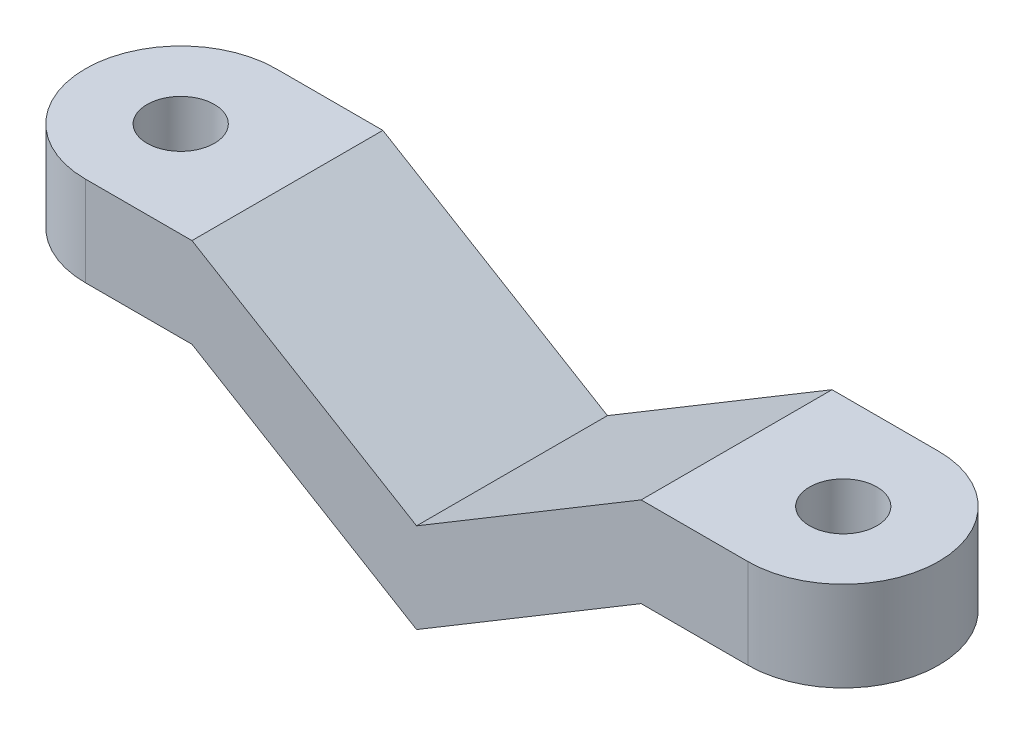
ISO-10303-21;
HEADER;
FILE_DESCRIPTION(('STEP AP214'),'2;1');
FILE_NAME('part.step','',(''),(''),'','','');
FILE_SCHEMA(('AUTOMOTIVE_DESIGN { 1 0 10303 214 1 1 1 1 }'));
ENDSEC;
DATA;
#1=APPLICATION_CONTEXT('core data for automotive mechanical design processes');
#2=APPLICATION_PROTOCOL_DEFINITION('international standard','automotive_design',2000,#1);
#3=PRODUCT_CONTEXT('',#1,'mechanical');
#4=PRODUCT('Part','Part','',(#3));
#5=PRODUCT_RELATED_PRODUCT_CATEGORY('part','',(#4));
#6=PRODUCT_DEFINITION_FORMATION('','',#4);
#7=PRODUCT_DEFINITION_CONTEXT('part definition',#1,'design');
#8=PRODUCT_DEFINITION('design','',#6,#7);
#9=PRODUCT_DEFINITION_SHAPE('','',#8);
#10=(LENGTH_UNIT() NAMED_UNIT(*) SI_UNIT(.MILLI.,.METRE.));
#11=(NAMED_UNIT(*) PLANE_ANGLE_UNIT() SI_UNIT($,.RADIAN.));
#12=(NAMED_UNIT(*) SI_UNIT($,.STERADIAN.) SOLID_ANGLE_UNIT());
#13=UNCERTAINTY_MEASURE_WITH_UNIT(LENGTH_MEASURE(1.E-05),#10,'distance_accuracy_value','');
#14=(GEOMETRIC_REPRESENTATION_CONTEXT(3) GLOBAL_UNCERTAINTY_ASSIGNED_CONTEXT((#13)) GLOBAL_UNIT_ASSIGNED_CONTEXT((#10,
#11,#12)) REPRESENTATION_CONTEXT('',''));
#15=CARTESIAN_POINT('',(0.,0.,0.));
#16=DIRECTION('',(0.,0.,1.));
#17=DIRECTION('',(1.,0.,0.));
#18=AXIS2_PLACEMENT_3D('',#15,#16,#17);
#19=CARTESIAN_POINT('',(0.,10.,4.25));
#20=DIRECTION('',(0.,0.,-1.));
#21=DIRECTION('',(-1.,0.,0.));
#22=AXIS2_PLACEMENT_3D('',#19,#20,#21);
#23=PLANE('',#22);
#24=DIRECTION('',(1.,0.,0.));
#25=VECTOR('',#24,1.);
#26=CARTESIAN_POINT('',(0.,6.,4.25));
#27=LINE('',#26,#25);
#28=CARTESIAN_POINT('',(24.75,6.,4.25));
#29=VERTEX_POINT('',#28);
#30=CARTESIAN_POINT('',(29.5,6.,4.25));
#31=VERTEX_POINT('',#30);
#32=EDGE_CURVE('E192',#29,#31,#27,.T.);
#33=ORIENTED_EDGE('',*,*,#32,.T.);
#34=DIRECTION('',(0.,-1.,0.));
#35=VECTOR('',#34,1.);
#36=CARTESIAN_POINT('',(29.5,10.,4.25));
#37=LINE('',#36,#35);
#38=CARTESIAN_POINT('',(29.5,10.,4.25));
#39=VERTEX_POINT('',#38);
#40=EDGE_CURVE('E245',#39,#31,#37,.T.);
#41=ORIENTED_EDGE('',*,*,#40,.F.);
#42=DIRECTION('',(1.,0.,0.));
#43=VECTOR('',#42,1.);
#44=CARTESIAN_POINT('',(0.,10.,4.25));
#45=LINE('',#44,#43);
#46=CARTESIAN_POINT('',(24.75,10.,4.25));
#47=VERTEX_POINT('',#46);
#48=EDGE_CURVE('E238',#47,#39,#45,.T.);
#49=ORIENTED_EDGE('',*,*,#48,.F.);
#50=DIRECTION('',(0.857492925712544,0.514495755427527,0.));
#51=VECTOR('',#50,1.);
#52=CARTESIAN_POINT('',(2.13970588235295,-3.56617647058824,4.25));
#53=LINE('',#52,#51);
#54=CARTESIAN_POINT('',(14.75,4.,4.25));
#55=VERTEX_POINT('',#54);
#56=EDGE_CURVE('E118',#55,#47,#53,.T.);
#57=ORIENTED_EDGE('',*,*,#56,.F.);
#58=DIRECTION('',(0.857492925712544,-0.514495755427526,0.));
#59=VECTOR('',#58,1.);
#60=CARTESIAN_POINT('',(5.66911764705882,9.44852941176471,4.25));
#61=LINE('',#60,#59);
#62=CARTESIAN_POINT('',(4.74999999999999,10.,4.25));
#63=VERTEX_POINT('',#62);
#64=EDGE_CURVE('E219',#63,#55,#61,.T.);
#65=ORIENTED_EDGE('',*,*,#64,.F.);
#66=CARTESIAN_POINT('',(0.,10.,4.25));
#67=VERTEX_POINT('',#66);
#68=EDGE_CURVE('E239',#67,#63,#45,.T.);
#69=ORIENTED_EDGE('',*,*,#68,.F.);
#70=DIRECTION('',(0.,-1.,0.));
#71=VECTOR('',#70,1.);
#72=CARTESIAN_POINT('',(0.,10.,4.25));
#73=LINE('',#72,#71);
#74=CARTESIAN_POINT('',(0.,6.,4.25));
#75=VERTEX_POINT('',#74);
#76=EDGE_CURVE('E126',#67,#75,#73,.T.);
#77=ORIENTED_EDGE('',*,*,#76,.T.);
#78=DIRECTION('',(1.,0.,0.));
#79=VECTOR('',#78,1.);
#80=CARTESIAN_POINT('',(0.,6.,4.25));
#81=LINE('',#80,#79);
#82=CARTESIAN_POINT('',(4.75,6.,4.25));
#83=VERTEX_POINT('',#82);
#84=EDGE_CURVE('E210',#75,#83,#81,.T.);
#85=ORIENTED_EDGE('',*,*,#84,.T.);
#86=DIRECTION('',(0.857492925712544,-0.514495755427526,0.));
#87=VECTOR('',#86,1.);
#88=CARTESIAN_POINT('',(3.90441176470588,6.50735294117647,4.25));
#89=LINE('',#88,#87);
#90=CARTESIAN_POINT('',(14.75,0.,4.25));
#91=VERTEX_POINT('',#90);
#92=EDGE_CURVE('E202',#83,#91,#89,.T.);
#93=ORIENTED_EDGE('',*,*,#92,.T.);
#94=DIRECTION('',(0.857492925712544,0.514495755427527,0.));
#95=VECTOR('',#94,1.);
#96=CARTESIAN_POINT('',(3.90441176470589,-6.50735294117647,4.25));
#97=LINE('',#96,#95);
#98=EDGE_CURVE('E184',#91,#29,#97,.T.);
#99=ORIENTED_EDGE('',*,*,#98,.T.);
#100=EDGE_LOOP('',(#33,#41,#49,#57,#65,#69,#77,#85,#93,#99));
#101=FACE_BOUND('',#100,.T.);
#102=ADVANCED_FACE('F101',(#101),#23,.F.);
#103=CARTESIAN_POINT('',(0.,10.,-4.25));
#104=DIRECTION('',(0.,0.,-1.));
#105=DIRECTION('',(-1.,0.,0.));
#106=AXIS2_PLACEMENT_3D('',#103,#104,#105);
#107=PLANE('',#106);
#108=DIRECTION('',(0.,-1.,0.));
#109=VECTOR('',#108,1.);
#110=CARTESIAN_POINT('',(29.5,10.,-4.25));
#111=LINE('',#110,#109);
#112=CARTESIAN_POINT('',(29.5,10.,-4.25));
#113=VERTEX_POINT('',#112);
#114=CARTESIAN_POINT('',(29.5,6.,-4.25));
#115=VERTEX_POINT('',#114);
#116=EDGE_CURVE('E247',#113,#115,#111,.T.);
#117=ORIENTED_EDGE('',*,*,#116,.T.);
#118=DIRECTION('',(-1.,0.,0.));
#119=VECTOR('',#118,1.);
#120=CARTESIAN_POINT('',(0.,6.,-4.25));
#121=LINE('',#120,#119);
#122=CARTESIAN_POINT('',(24.75,6.,-4.25));
#123=VERTEX_POINT('',#122);
#124=EDGE_CURVE('E207',#115,#123,#121,.T.);
#125=ORIENTED_EDGE('',*,*,#124,.T.);
#126=DIRECTION('',(-0.857492925712544,-0.514495755427527,0.));
#127=VECTOR('',#126,1.);
#128=CARTESIAN_POINT('',(8.31617647058824,-3.86029411764706,-4.25));
#129=LINE('',#128,#127);
#130=CARTESIAN_POINT('',(14.75,0.,-4.25));
#131=VERTEX_POINT('',#130);
#132=EDGE_CURVE('E187',#123,#131,#129,.T.);
#133=ORIENTED_EDGE('',*,*,#132,.T.);
#134=DIRECTION('',(-0.857492925712544,0.514495755427526,0.));
#135=VECTOR('',#134,1.);
#136=CARTESIAN_POINT('',(-0.507352941176471,9.15441176470588,-4.25));
#137=LINE('',#136,#135);
#138=CARTESIAN_POINT('',(4.75,6.,-4.25));
#139=VERTEX_POINT('',#138);
#140=EDGE_CURVE('E214',#131,#139,#137,.T.);
#141=ORIENTED_EDGE('',*,*,#140,.T.);
#142=DIRECTION('',(-1.,0.,0.));
#143=VECTOR('',#142,1.);
#144=CARTESIAN_POINT('',(0.,6.,-4.25));
#145=LINE('',#144,#143);
#146=CARTESIAN_POINT('',(0.,6.,-4.25));
#147=VERTEX_POINT('',#146);
#148=EDGE_CURVE('E110',#139,#147,#145,.T.);
#149=ORIENTED_EDGE('',*,*,#148,.T.);
#150=DIRECTION('',(0.,-1.,0.));
#151=VECTOR('',#150,1.);
#152=CARTESIAN_POINT('',(0.,10.,-4.25));
#153=LINE('',#152,#151);
#154=CARTESIAN_POINT('',(0.,10.,-4.25));
#155=VERTEX_POINT('',#154);
#156=EDGE_CURVE('E242',#155,#147,#153,.T.);
#157=ORIENTED_EDGE('',*,*,#156,.F.);
#158=DIRECTION('',(1.,0.,0.));
#159=VECTOR('',#158,1.);
#160=CARTESIAN_POINT('',(0.,10.,-4.25));
#161=LINE('',#160,#159);
#162=CARTESIAN_POINT('',(4.74999999999999,10.,-4.25));
#163=VERTEX_POINT('',#162);
#164=EDGE_CURVE('E232',#155,#163,#161,.T.);
#165=ORIENTED_EDGE('',*,*,#164,.T.);
#166=DIRECTION('',(-0.857492925712544,0.514495755427526,0.));
#167=VECTOR('',#166,1.);
#168=CARTESIAN_POINT('',(1.25735294117647,12.0955882352941,-4.25));
#169=LINE('',#168,#167);
#170=CARTESIAN_POINT('',(14.75,4.,-4.25));
#171=VERTEX_POINT('',#170);
#172=EDGE_CURVE('E227',#171,#163,#169,.T.);
#173=ORIENTED_EDGE('',*,*,#172,.F.);
#174=DIRECTION('',(-0.857492925712544,-0.514495755427527,0.));
#175=VECTOR('',#174,1.);
#176=CARTESIAN_POINT('',(6.5514705882353,-0.919117647058831,-4.25));
#177=LINE('',#176,#175);
#178=CARTESIAN_POINT('',(24.75,10.,-4.25));
#179=VERTEX_POINT('',#178);
#180=EDGE_CURVE('E225',#179,#171,#177,.T.);
#181=ORIENTED_EDGE('',*,*,#180,.F.);
#182=EDGE_CURVE('E231',#179,#113,#161,.T.);
#183=ORIENTED_EDGE('',*,*,#182,.T.);
#184=EDGE_LOOP('',(#117,#125,#133,#141,#149,#157,#165,#173,#181,#183));
#185=FACE_BOUND('',#184,.T.);
#186=ADVANCED_FACE('F286',(#185),#107,.T.);
#187=CARTESIAN_POINT('',(29.5,10.,0.));
#188=DIRECTION('',(0.,-1.,0.));
#189=DIRECTION('',(0.,0.,-1.));
#190=AXIS2_PLACEMENT_3D('',#187,#188,#189);
#191=CYLINDRICAL_SURFACE('',#190,4.25);
#192=ORIENTED_EDGE('',*,*,#40,.T.);
#193=CARTESIAN_POINT('',(29.5,6.,0.));
#194=DIRECTION('',(0.,-1.,0.));
#195=DIRECTION('',(0.,0.,-1.));
#196=AXIS2_PLACEMENT_3D('',#193,#194,#195);
#197=CIRCLE('',#196,4.25);
#198=EDGE_CURVE('E12',#31,#115,#197,.F.);
#199=ORIENTED_EDGE('',*,*,#198,.T.);
#200=ORIENTED_EDGE('',*,*,#116,.F.);
#201=CARTESIAN_POINT('',(29.5,10.,0.));
#202=DIRECTION('',(0.,-1.,0.));
#203=DIRECTION('',(0.,0.,-1.));
#204=AXIS2_PLACEMENT_3D('',#201,#202,#203);
#205=CIRCLE('',#204,4.25);
#206=EDGE_CURVE('E235',#113,#39,#205,.T.);
#207=ORIENTED_EDGE('',*,*,#206,.T.);
#208=EDGE_LOOP('',(#192,#199,#200,#207));
#209=FACE_BOUND('',#208,.T.);
#210=ADVANCED_FACE('F289',(#209),#191,.T.);
#211=CARTESIAN_POINT('',(0.,10.,0.));
#212=DIRECTION('',(0.,-1.,0.));
#213=DIRECTION('',(0.,0.,-1.));
#214=AXIS2_PLACEMENT_3D('',#211,#212,#213);
#215=CYLINDRICAL_SURFACE('',#214,4.25);
#216=CARTESIAN_POINT('',(0.,6.,0.));
#217=DIRECTION('',(0.,-1.,0.));
#218=DIRECTION('',(0.,0.,-1.));
#219=AXIS2_PLACEMENT_3D('',#216,#217,#218);
#220=CIRCLE('',#219,4.25);
#221=EDGE_CURVE('E217',#147,#75,#220,.F.);
#222=ORIENTED_EDGE('',*,*,#221,.T.);
#223=ORIENTED_EDGE('',*,*,#76,.F.);
#224=CARTESIAN_POINT('',(0.,10.,0.));
#225=DIRECTION('',(0.,-1.,0.));
#226=DIRECTION('',(0.,0.,-1.));
#227=AXIS2_PLACEMENT_3D('',#224,#225,#226);
#228=CIRCLE('',#227,4.25);
#229=EDGE_CURVE('E229',#67,#155,#228,.T.);
#230=ORIENTED_EDGE('',*,*,#229,.T.);
#231=ORIENTED_EDGE('',*,*,#156,.T.);
#232=EDGE_LOOP('',(#222,#223,#230,#231));
#233=FACE_BOUND('',#232,.T.);
#234=ADVANCED_FACE('F103',(#233),#215,.T.);
#235=CARTESIAN_POINT('',(0.,10.,0.));
#236=DIRECTION('',(0.,-1.,0.));
#237=DIRECTION('',(0.,0.,-1.));
#238=AXIS2_PLACEMENT_3D('',#235,#236,#237);
#239=PLANE('',#238);
#240=CARTESIAN_POINT('',(0.,10.,0.));
#241=DIRECTION('',(0.,1.,0.));
#242=DIRECTION('',(0.,0.,1.));
#243=AXIS2_PLACEMENT_3D('',#240,#241,#242);
#244=CIRCLE('',#243,1.5);
#245=CARTESIAN_POINT('',(0.,10.,1.5));
#246=VERTEX_POINT('',#245);
#247=EDGE_CURVE('E260',#246,#246,#244,.T.);
#248=ORIENTED_EDGE('',*,*,#247,.F.);
#249=EDGE_LOOP('',(#248));
#250=FACE_BOUND('',#249,.T.);
#251=ORIENTED_EDGE('',*,*,#68,.T.);
#252=DIRECTION('',(0.,0.,-1.));
#253=VECTOR('',#252,1.);
#254=CARTESIAN_POINT('',(4.75,10.,0.));
#255=LINE('',#254,#253);
#256=EDGE_CURVE('E253',#63,#163,#255,.T.);
#257=ORIENTED_EDGE('',*,*,#256,.T.);
#258=ORIENTED_EDGE('',*,*,#164,.F.);
#259=ORIENTED_EDGE('',*,*,#229,.F.);
#260=EDGE_LOOP('',(#251,#257,#258,#259));
#261=FACE_BOUND('',#260,.T.);
#262=ADVANCED_FACE('F278',(#250,#261),#239,.F.);
#263=CARTESIAN_POINT('',(29.5,10.,0.));
#264=DIRECTION('',(0.,1.,0.));
#265=DIRECTION('',(0.,0.,1.));
#266=AXIS2_PLACEMENT_3D('',#263,#264,#265);
#267=CIRCLE('',#266,1.5);
#268=CARTESIAN_POINT('',(29.5,10.,1.5));
#269=VERTEX_POINT('',#268);
#270=EDGE_CURVE('E267',#269,#269,#267,.T.);
#271=ORIENTED_EDGE('',*,*,#270,.F.);
#272=EDGE_LOOP('',(#271));
#273=FACE_BOUND('',#272,.T.);
#274=ORIENTED_EDGE('',*,*,#182,.F.);
#275=DIRECTION('',(0.,0.,1.));
#276=VECTOR('',#275,1.);
#277=CARTESIAN_POINT('',(24.75,10.,0.));
#278=LINE('',#277,#276);
#279=EDGE_CURVE('E244',#179,#47,#278,.T.);
#280=ORIENTED_EDGE('',*,*,#279,.T.);
#281=ORIENTED_EDGE('',*,*,#48,.T.);
#282=ORIENTED_EDGE('',*,*,#206,.F.);
#283=EDGE_LOOP('',(#274,#280,#281,#282));
#284=FACE_BOUND('',#283,.T.);
#285=ADVANCED_FACE('F274',(#273,#284),#239,.F.);
#286=CARTESIAN_POINT('',(5.66911764705882,9.44852941176471,-5.75));
#287=DIRECTION('',(-0.514495755427526,-0.857492925712544,0.));
#288=DIRECTION('',(0.857492925712544,-0.514495755427526,0.));
#289=AXIS2_PLACEMENT_3D('',#286,#287,#288);
#290=PLANE('',#289);
#291=ORIENTED_EDGE('',*,*,#172,.T.);
#292=ORIENTED_EDGE('',*,*,#256,.F.);
#293=ORIENTED_EDGE('',*,*,#64,.T.);
#294=DIRECTION('',(0.,0.,1.));
#295=VECTOR('',#294,1.);
#296=CARTESIAN_POINT('',(14.75,4.,-5.75));
#297=LINE('',#296,#295);
#298=EDGE_CURVE('E223',#171,#55,#297,.T.);
#299=ORIENTED_EDGE('',*,*,#298,.F.);
#300=EDGE_LOOP('',(#291,#292,#293,#299));
#301=FACE_BOUND('',#300,.T.);
#302=ADVANCED_FACE('F277',(#301),#290,.F.);
#303=CARTESIAN_POINT('',(2.13970588235295,-3.56617647058824,-5.75));
#304=DIRECTION('',(0.514495755427527,-0.857492925712544,0.));
#305=DIRECTION('',(0.857492925712544,0.514495755427527,0.));
#306=AXIS2_PLACEMENT_3D('',#303,#304,#305);
#307=PLANE('',#306);
#308=ORIENTED_EDGE('',*,*,#180,.T.);
#309=ORIENTED_EDGE('',*,*,#298,.T.);
#310=ORIENTED_EDGE('',*,*,#56,.T.);
#311=ORIENTED_EDGE('',*,*,#279,.F.);
#312=EDGE_LOOP('',(#308,#309,#310,#311));
#313=FACE_BOUND('',#312,.T.);
#314=ADVANCED_FACE('F304',(#313),#307,.F.);
#315=CARTESIAN_POINT('',(3.90441176470588,6.50735294117647,-5.75));
#316=DIRECTION('',(-0.514495755427526,-0.857492925712544,0.));
#317=DIRECTION('',(0.857492925712544,-0.514495755427526,0.));
#318=AXIS2_PLACEMENT_3D('',#315,#316,#317);
#319=PLANE('',#318);
#320=DIRECTION('',(0.,0.,-1.));
#321=VECTOR('',#320,1.);
#322=CARTESIAN_POINT('',(14.75,0.,0.));
#323=LINE('',#322,#321);
#324=EDGE_CURVE('E256',#91,#131,#323,.T.);
#325=ORIENTED_EDGE('',*,*,#324,.F.);
#326=ORIENTED_EDGE('',*,*,#92,.F.);
#327=DIRECTION('',(0.,0.,1.));
#328=VECTOR('',#327,1.);
#329=CARTESIAN_POINT('',(4.75,6.,-5.75));
#330=LINE('',#329,#328);
#331=EDGE_CURVE('E212',#139,#83,#330,.T.);
#332=ORIENTED_EDGE('',*,*,#331,.F.);
#333=ORIENTED_EDGE('',*,*,#140,.F.);
#334=EDGE_LOOP('',(#325,#326,#332,#333));
#335=FACE_BOUND('',#334,.T.);
#336=ADVANCED_FACE('F302',(#335),#319,.T.);
#337=CARTESIAN_POINT('',(0.,6.,-5.75));
#338=DIRECTION('',(0.,-1.,0.));
#339=DIRECTION('',(0.,0.,-1.));
#340=AXIS2_PLACEMENT_3D('',#337,#338,#339);
#341=PLANE('',#340);
#342=CARTESIAN_POINT('',(0.,6.,0.));
#343=DIRECTION('',(0.,-1.,0.));
#344=DIRECTION('',(0.,0.,-1.));
#345=AXIS2_PLACEMENT_3D('',#342,#343,#344);
#346=CIRCLE('',#345,1.5);
#347=CARTESIAN_POINT('',(0.,6.,-1.5));
#348=VERTEX_POINT('',#347);
#349=EDGE_CURVE('E197',#348,#348,#346,.T.);
#350=ORIENTED_EDGE('',*,*,#349,.F.);
#351=EDGE_LOOP('',(#350));
#352=FACE_BOUND('',#351,.T.);
#353=ORIENTED_EDGE('',*,*,#221,.F.);
#354=ORIENTED_EDGE('',*,*,#148,.F.);
#355=ORIENTED_EDGE('',*,*,#331,.T.);
#356=ORIENTED_EDGE('',*,*,#84,.F.);
#357=EDGE_LOOP('',(#353,#354,#355,#356));
#358=FACE_BOUND('',#357,.T.);
#359=ADVANCED_FACE('F300',(#352,#358),#341,.T.);
#360=CARTESIAN_POINT('',(0.,6.,-5.75));
#361=DIRECTION('',(0.,-1.,0.));
#362=DIRECTION('',(0.,0.,-1.));
#363=AXIS2_PLACEMENT_3D('',#360,#361,#362);
#364=PLANE('',#363);
#365=CARTESIAN_POINT('',(29.5,6.,0.));
#366=DIRECTION('',(0.,-1.,0.));
#367=DIRECTION('',(0.,0.,-1.));
#368=AXIS2_PLACEMENT_3D('',#365,#366,#367);
#369=CIRCLE('',#368,1.5);
#370=CARTESIAN_POINT('',(29.5,6.,-1.5));
#371=VERTEX_POINT('',#370);
#372=EDGE_CURVE('E105',#371,#371,#369,.T.);
#373=ORIENTED_EDGE('',*,*,#372,.F.);
#374=EDGE_LOOP('',(#373));
#375=FACE_BOUND('',#374,.T.);
#376=ORIENTED_EDGE('',*,*,#198,.F.);
#377=ORIENTED_EDGE('',*,*,#32,.F.);
#378=DIRECTION('',(0.,0.,1.));
#379=VECTOR('',#378,1.);
#380=CARTESIAN_POINT('',(24.75,6.,-5.75));
#381=LINE('',#380,#379);
#382=EDGE_CURVE('E180',#123,#29,#381,.T.);
#383=ORIENTED_EDGE('',*,*,#382,.F.);
#384=ORIENTED_EDGE('',*,*,#124,.F.);
#385=EDGE_LOOP('',(#376,#377,#383,#384));
#386=FACE_BOUND('',#385,.T.);
#387=ADVANCED_FACE('F193',(#375,#386),#364,.T.);
#388=CARTESIAN_POINT('',(3.90441176470589,-6.50735294117647,-5.75));
#389=DIRECTION('',(0.514495755427527,-0.857492925712544,0.));
#390=DIRECTION('',(0.857492925712544,0.514495755427527,0.));
#391=AXIS2_PLACEMENT_3D('',#388,#389,#390);
#392=PLANE('',#391);
#393=ORIENTED_EDGE('',*,*,#382,.T.);
#394=ORIENTED_EDGE('',*,*,#98,.F.);
#395=ORIENTED_EDGE('',*,*,#324,.T.);
#396=ORIENTED_EDGE('',*,*,#132,.F.);
#397=EDGE_LOOP('',(#393,#394,#395,#396));
#398=FACE_BOUND('',#397,.T.);
#399=ADVANCED_FACE('F182',(#398),#392,.T.);
#400=CARTESIAN_POINT('',(0.,0.,0.));
#401=DIRECTION('',(0.,1.,0.));
#402=DIRECTION('',(0.,0.,1.));
#403=AXIS2_PLACEMENT_3D('',#400,#401,#402);
#404=CYLINDRICAL_SURFACE('',#403,1.5);
#405=ORIENTED_EDGE('',*,*,#349,.T.);
#406=EDGE_LOOP('',(#405));
#407=FACE_BOUND('',#406,.T.);
#408=ORIENTED_EDGE('',*,*,#247,.T.);
#409=EDGE_LOOP('',(#408));
#410=FACE_BOUND('',#409,.T.);
#411=ADVANCED_FACE('F359',(#407,#410),#404,.F.);
#412=CARTESIAN_POINT('',(29.5,0.,0.));
#413=DIRECTION('',(0.,1.,0.));
#414=DIRECTION('',(0.,0.,1.));
#415=AXIS2_PLACEMENT_3D('',#412,#413,#414);
#416=CYLINDRICAL_SURFACE('',#415,1.5);
#417=ORIENTED_EDGE('',*,*,#372,.T.);
#418=EDGE_LOOP('',(#417));
#419=FACE_BOUND('',#418,.T.);
#420=ORIENTED_EDGE('',*,*,#270,.T.);
#421=EDGE_LOOP('',(#420));
#422=FACE_BOUND('',#421,.T.);
#423=ADVANCED_FACE('F272',(#419,#422),#416,.F.);
#424=CLOSED_SHELL('',(#102,#186,#210,#234,#262,#285,#302,#314,#336,#359,#387,#399,#411,#423));
#425=MANIFOLD_SOLID_BREP('B2',#424);
#426=ADVANCED_BREP_SHAPE_REPRESENTATION('',(#18,#425),#14);
#427=SHAPE_DEFINITION_REPRESENTATION(#9,#426);
ENDSEC;
END-ISO-10303-21;
